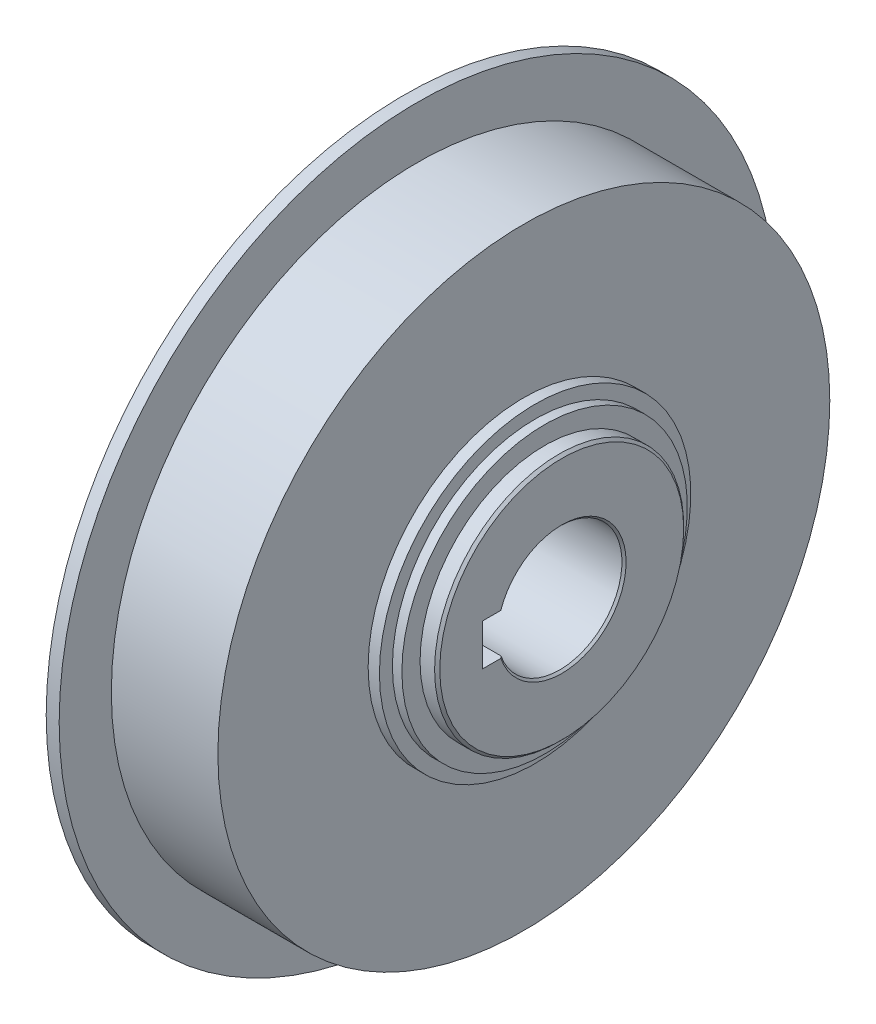
ISO-10303-21;
HEADER;
FILE_DESCRIPTION(('STEP AP214'),'2;1');
FILE_NAME('part.step','',(''),(''),'','','');
FILE_SCHEMA(('AUTOMOTIVE_DESIGN { 1 0 10303 214 1 1 1 1 }'));
ENDSEC;
DATA;
#1=APPLICATION_CONTEXT('core data for automotive mechanical design processes');
#2=APPLICATION_PROTOCOL_DEFINITION('international standard','automotive_design',2000,#1);
#3=PRODUCT_CONTEXT('',#1,'mechanical');
#4=PRODUCT('Part','Part','',(#3));
#5=PRODUCT_RELATED_PRODUCT_CATEGORY('part','',(#4));
#6=PRODUCT_DEFINITION_FORMATION('','',#4);
#7=PRODUCT_DEFINITION_CONTEXT('part definition',#1,'design');
#8=PRODUCT_DEFINITION('design','',#6,#7);
#9=PRODUCT_DEFINITION_SHAPE('','',#8);
#10=(LENGTH_UNIT() NAMED_UNIT(*) SI_UNIT(.MILLI.,.METRE.));
#11=(NAMED_UNIT(*) PLANE_ANGLE_UNIT() SI_UNIT($,.RADIAN.));
#12=(NAMED_UNIT(*) SI_UNIT($,.STERADIAN.) SOLID_ANGLE_UNIT());
#13=UNCERTAINTY_MEASURE_WITH_UNIT(LENGTH_MEASURE(1.E-05),#10,'distance_accuracy_value','');
#14=(GEOMETRIC_REPRESENTATION_CONTEXT(3) GLOBAL_UNCERTAINTY_ASSIGNED_CONTEXT((#13)) GLOBAL_UNIT_ASSIGNED_CONTEXT((#10,
#11,#12)) REPRESENTATION_CONTEXT('',''));
#15=CARTESIAN_POINT('',(0.,0.,0.));
#16=DIRECTION('',(0.,0.,1.));
#17=DIRECTION('',(1.,0.,0.));
#18=AXIS2_PLACEMENT_3D('',#15,#16,#17);
#19=CARTESIAN_POINT('',(83.,0.,0.));
#20=DIRECTION('',(1.,0.,0.));
#21=DIRECTION('',(0.,0.,-1.));
#22=AXIS2_PLACEMENT_3D('',#19,#20,#21);
#23=CONICAL_SURFACE('',#22,12.4,0.785398163397444);
#24=CARTESIAN_POINT('',(82.6,0.,0.));
#25=DIRECTION('',(-1.,0.,0.));
#26=DIRECTION('',(0.,0.,1.));
#27=AXIS2_PLACEMENT_3D('',#24,#25,#26);
#28=CIRCLE('',#27,12.);
#29=CARTESIAN_POINT('',(82.6,4.,11.3137084989848));
#30=VERTEX_POINT('',#29);
#31=CARTESIAN_POINT('',(82.6,-4.,11.3137084989848));
#32=VERTEX_POINT('',#31);
#33=EDGE_CURVE('E80',#30,#32,#28,.T.);
#34=ORIENTED_EDGE('',*,*,#33,.T.);
#35=CARTESIAN_POINT('',(83.,-4.,11.737120600897));
#36=CARTESIAN_POINT('',(82.9332637530497,-4.,11.6666176506962));
#37=CARTESIAN_POINT('',(82.8665622963739,-4.,11.5960818339105));
#38=CARTESIAN_POINT('',(82.73322896304,-4.,11.454944466607));
#39=CARTESIAN_POINT('',(82.6665970863825,-4.,11.3843429160886));
#40=CARTESIAN_POINT('',(82.6,-4.,11.3137084989848));
#41=B_SPLINE_CURVE_WITH_KNOTS('',3,(#35,#36,#37,#38,#39,#40),.UNSPECIFIED.,.F.,.F.,(4,2,4),(0.,
0.291237827128781,0.58247565657841),.UNSPECIFIED.);
#42=CARTESIAN_POINT('',(83.,-4.,11.737120600897));
#43=VERTEX_POINT('',#42);
#44=EDGE_CURVE('E75',#43,#32,#41,.T.);
#45=ORIENTED_EDGE('',*,*,#44,.F.);
#46=CARTESIAN_POINT('',(83.,0.,0.));
#47=DIRECTION('',(1.,0.,0.));
#48=DIRECTION('',(0.,0.,-1.));
#49=AXIS2_PLACEMENT_3D('',#46,#47,#48);
#50=CIRCLE('',#49,12.4);
#51=CARTESIAN_POINT('',(83.,4.,11.737120600897));
#52=VERTEX_POINT('',#51);
#53=EDGE_CURVE('E73',#52,#43,#50,.F.);
#54=ORIENTED_EDGE('',*,*,#53,.F.);
#55=CARTESIAN_POINT('',(82.6,4.,11.3137084989848));
#56=CARTESIAN_POINT('',(82.6665970863825,4.,11.3843429160886));
#57=CARTESIAN_POINT('',(82.73322896304,4.,11.454944466607));
#58=CARTESIAN_POINT('',(82.8665622963739,4.,11.5960818339105));
#59=CARTESIAN_POINT('',(82.9332637530497,4.,11.6666176506962));
#60=CARTESIAN_POINT('',(83.,4.,11.737120600897));
#61=B_SPLINE_CURVE_WITH_KNOTS('',3,(#55,#56,#57,#58,#59,#60),.UNSPECIFIED.,.F.,.F.,(4,2,4),(0.,
0.291237829449631,0.582475656578424),.UNSPECIFIED.);
#62=EDGE_CURVE('E21',#30,#52,#61,.T.);
#63=ORIENTED_EDGE('',*,*,#62,.F.);
#64=EDGE_LOOP('',(#34,#45,#54,#63));
#65=FACE_BOUND('',#64,.T.);
#66=ADVANCED_FACE('F17',(#65),#23,.F.);
#67=CARTESIAN_POINT('',(62.55,0.,0.));
#68=DIRECTION('',(-1.,0.,0.));
#69=DIRECTION('',(0.,0.,1.));
#70=AXIS2_PLACEMENT_3D('',#67,#68,#69);
#71=CYLINDRICAL_SURFACE('',#70,12.);
#72=ORIENTED_EDGE('',*,*,#33,.F.);
#73=DIRECTION('',(1.,0.,0.));
#74=VECTOR('',#73,1.);
#75=CARTESIAN_POINT('',(62.55,4.,11.3137084989848));
#76=LINE('',#75,#74);
#77=CARTESIAN_POINT('',(42.5,4.,11.3137084989848));
#78=VERTEX_POINT('',#77);
#79=EDGE_CURVE('E88',#78,#30,#76,.T.);
#80=ORIENTED_EDGE('',*,*,#79,.F.);
#81=CARTESIAN_POINT('',(42.5,0.,0.));
#82=DIRECTION('',(-1.,0.,0.));
#83=DIRECTION('',(0.,0.,1.));
#84=AXIS2_PLACEMENT_3D('',#81,#82,#83);
#85=CIRCLE('',#84,12.);
#86=CARTESIAN_POINT('',(42.5,-4.,11.3137084989848));
#87=VERTEX_POINT('',#86);
#88=EDGE_CURVE('E94',#78,#87,#85,.T.);
#89=ORIENTED_EDGE('',*,*,#88,.T.);
#90=DIRECTION('',(1.,0.,0.));
#91=VECTOR('',#90,1.);
#92=CARTESIAN_POINT('',(62.55,-4.,11.3137084989848));
#93=LINE('',#92,#91);
#94=EDGE_CURVE('E79',#32,#87,#93,.F.);
#95=ORIENTED_EDGE('',*,*,#94,.F.);
#96=EDGE_LOOP('',(#72,#80,#89,#95));
#97=FACE_BOUND('',#96,.T.);
#98=ADVANCED_FACE('F308',(#97),#71,.F.);
#99=CARTESIAN_POINT('',(83.,0.,17.95));
#100=DIRECTION('',(1.,0.,0.));
#101=DIRECTION('',(0.,0.,-1.));
#102=AXIS2_PLACEMENT_3D('',#99,#100,#101);
#103=PLANE('',#102);
#104=DIRECTION('',(0.,0.,-1.));
#105=VECTOR('',#104,1.);
#106=CARTESIAN_POINT('',(83.,4.,7.65));
#107=LINE('',#106,#105);
#108=CARTESIAN_POINT('',(83.,4.,15.3));
#109=VERTEX_POINT('',#108);
#110=EDGE_CURVE('E85',#52,#109,#107,.F.);
#111=ORIENTED_EDGE('',*,*,#110,.F.);
#112=ORIENTED_EDGE('',*,*,#53,.T.);
#113=DIRECTION('',(0.,0.,1.));
#114=VECTOR('',#113,1.);
#115=CARTESIAN_POINT('',(83.,-4.,7.65));
#116=LINE('',#115,#114);
#117=CARTESIAN_POINT('',(83.,-4.,15.3));
#118=VERTEX_POINT('',#117);
#119=EDGE_CURVE('E110',#118,#43,#116,.F.);
#120=ORIENTED_EDGE('',*,*,#119,.F.);
#121=DIRECTION('',(0.,1.,0.));
#122=VECTOR('',#121,1.);
#123=CARTESIAN_POINT('',(83.,0.,15.3));
#124=LINE('',#123,#122);
#125=EDGE_CURVE('E92',#118,#109,#124,.T.);
#126=ORIENTED_EDGE('',*,*,#125,.T.);
#127=EDGE_LOOP('',(#111,#112,#120,#126));
#128=FACE_BOUND('',#127,.T.);
#129=CARTESIAN_POINT('',(83.,0.,0.));
#130=DIRECTION('',(-1.,0.,0.));
#131=DIRECTION('',(0.,0.,1.));
#132=AXIS2_PLACEMENT_3D('',#129,#130,#131);
#133=CIRCLE('',#132,23.5);
#134=CARTESIAN_POINT('',(83.,0.,23.5));
#135=VERTEX_POINT('',#134);
#136=EDGE_CURVE('E149',#135,#135,#133,.T.);
#137=ORIENTED_EDGE('',*,*,#136,.F.);
#138=EDGE_LOOP('',(#137));
#139=FACE_BOUND('',#138,.T.);
#140=ADVANCED_FACE('F89',(#128,#139),#103,.T.);
#141=CARTESIAN_POINT('',(62.55,-4.,7.65));
#142=DIRECTION('',(0.,1.,0.));
#143=DIRECTION('',(0.,0.,1.));
#144=AXIS2_PLACEMENT_3D('',#141,#142,#143);
#145=PLANE('',#144);
#146=DIRECTION('',(1.,0.,0.));
#147=VECTOR('',#146,1.);
#148=CARTESIAN_POINT('',(62.55,-4.,15.3));
#149=LINE('',#148,#147);
#150=CARTESIAN_POINT('',(42.1,-4.,15.3));
#151=VERTEX_POINT('',#150);
#152=EDGE_CURVE('E384',#151,#118,#149,.T.);
#153=ORIENTED_EDGE('',*,*,#152,.T.);
#154=ORIENTED_EDGE('',*,*,#119,.T.);
#155=ORIENTED_EDGE('',*,*,#44,.T.);
#156=ORIENTED_EDGE('',*,*,#94,.T.);
#157=CARTESIAN_POINT('',(42.5,-4.,11.3137084989848));
#158=CARTESIAN_POINT('',(42.4334029136175,-4.,11.3843429160886));
#159=CARTESIAN_POINT('',(42.36677103696,-4.,11.454944466607));
#160=CARTESIAN_POINT('',(42.2334377036261,-4.,11.5960818339105));
#161=CARTESIAN_POINT('',(42.1667362469503,-4.,11.6666176506962));
#162=CARTESIAN_POINT('',(42.1,-4.,11.737120600897));
#163=B_SPLINE_CURVE_WITH_KNOTS('',3,(#157,#158,#159,#160,#161,#162),.UNSPECIFIED.,.F.,.F.,(4,2,
4),(0.,0.291237829449631,0.582475656578412),.UNSPECIFIED.);
#164=CARTESIAN_POINT('',(42.1,-4.,11.737120600897));
#165=VERTEX_POINT('',#164);
#166=EDGE_CURVE('E97',#87,#165,#163,.T.);
#167=ORIENTED_EDGE('',*,*,#166,.T.);
#168=DIRECTION('',(0.,0.,1.));
#169=VECTOR('',#168,1.);
#170=CARTESIAN_POINT('',(42.1,-4.,32.2625));
#171=LINE('',#170,#169);
#172=EDGE_CURVE('E148',#151,#165,#171,.F.);
#173=ORIENTED_EDGE('',*,*,#172,.F.);
#174=EDGE_LOOP('',(#153,#154,#155,#156,#167,#173));
#175=FACE_BOUND('',#174,.T.);
#176=ADVANCED_FACE('F295',(#175),#145,.T.);
#177=CARTESIAN_POINT('',(42.1,0.,0.));
#178=DIRECTION('',(-1.,0.,0.));
#179=DIRECTION('',(0.,0.,1.));
#180=AXIS2_PLACEMENT_3D('',#177,#178,#179);
#181=CONICAL_SURFACE('',#180,12.4,0.78539816339745);
#182=ORIENTED_EDGE('',*,*,#88,.F.);
#183=CARTESIAN_POINT('',(42.1,4.,11.737120600897));
#184=CARTESIAN_POINT('',(42.1667362469503,4.,11.6666176506962));
#185=CARTESIAN_POINT('',(42.2334377036261,4.,11.5960818339105));
#186=CARTESIAN_POINT('',(42.36677103696,4.,11.454944466607));
#187=CARTESIAN_POINT('',(42.4334029136175,4.,11.3843429160886));
#188=CARTESIAN_POINT('',(42.5,4.,11.3137084989848));
#189=B_SPLINE_CURVE_WITH_KNOTS('',3,(#183,#184,#185,#186,#187,#188),.UNSPECIFIED.,.F.,.F.,(4,2,
4),(0.,0.291237827128772,0.582475656578396),.UNSPECIFIED.);
#190=CARTESIAN_POINT('',(42.1,4.,11.737120600897));
#191=VERTEX_POINT('',#190);
#192=EDGE_CURVE('E93',#191,#78,#189,.T.);
#193=ORIENTED_EDGE('',*,*,#192,.F.);
#194=CARTESIAN_POINT('',(42.1,0.,0.));
#195=DIRECTION('',(-1.,0.,0.));
#196=DIRECTION('',(0.,0.,1.));
#197=AXIS2_PLACEMENT_3D('',#194,#195,#196);
#198=CIRCLE('',#197,12.4);
#199=EDGE_CURVE('E144',#165,#191,#198,.F.);
#200=ORIENTED_EDGE('',*,*,#199,.F.);
#201=ORIENTED_EDGE('',*,*,#166,.F.);
#202=EDGE_LOOP('',(#182,#193,#200,#201));
#203=FACE_BOUND('',#202,.T.);
#204=ADVANCED_FACE('F160',(#203),#181,.F.);
#205=CARTESIAN_POINT('',(62.55,4.,7.65));
#206=DIRECTION('',(0.,-1.,0.));
#207=DIRECTION('',(0.,0.,-1.));
#208=AXIS2_PLACEMENT_3D('',#205,#206,#207);
#209=PLANE('',#208);
#210=ORIENTED_EDGE('',*,*,#192,.T.);
#211=ORIENTED_EDGE('',*,*,#79,.T.);
#212=ORIENTED_EDGE('',*,*,#62,.T.);
#213=ORIENTED_EDGE('',*,*,#110,.T.);
#214=DIRECTION('',(1.,0.,0.));
#215=VECTOR('',#214,1.);
#216=CARTESIAN_POINT('',(62.55,4.,15.3));
#217=LINE('',#216,#215);
#218=CARTESIAN_POINT('',(42.1,4.,15.3));
#219=VERTEX_POINT('',#218);
#220=EDGE_CURVE('E40',#109,#219,#217,.F.);
#221=ORIENTED_EDGE('',*,*,#220,.T.);
#222=DIRECTION('',(0.,0.,1.));
#223=VECTOR('',#222,1.);
#224=CARTESIAN_POINT('',(42.1,4.,32.2625));
#225=LINE('',#224,#223);
#226=EDGE_CURVE('E147',#191,#219,#225,.T.);
#227=ORIENTED_EDGE('',*,*,#226,.F.);
#228=EDGE_LOOP('',(#210,#211,#212,#213,#221,#227));
#229=FACE_BOUND('',#228,.T.);
#230=ADVANCED_FACE('F84',(#229),#209,.T.);
#231=CARTESIAN_POINT('',(62.55,0.,15.3));
#232=DIRECTION('',(0.,0.,1.));
#233=DIRECTION('',(1.,0.,0.));
#234=AXIS2_PLACEMENT_3D('',#231,#232,#233);
#235=PLANE('',#234);
#236=ORIENTED_EDGE('',*,*,#152,.F.);
#237=DIRECTION('',(0.,1.,0.));
#238=VECTOR('',#237,1.);
#239=CARTESIAN_POINT('',(42.1,0.,15.3));
#240=LINE('',#239,#238);
#241=EDGE_CURVE('E392',#219,#151,#240,.F.);
#242=ORIENTED_EDGE('',*,*,#241,.F.);
#243=ORIENTED_EDGE('',*,*,#220,.F.);
#244=ORIENTED_EDGE('',*,*,#125,.F.);
#245=EDGE_LOOP('',(#236,#242,#243,#244));
#246=FACE_BOUND('',#245,.T.);
#247=ADVANCED_FACE('F165',(#246),#235,.F.);
#248=CARTESIAN_POINT('',(82.5,0.,0.));
#249=DIRECTION('',(-1.,0.,0.));
#250=DIRECTION('',(0.,0.,1.));
#251=AXIS2_PLACEMENT_3D('',#248,#249,#250);
#252=CONICAL_SURFACE('',#251,24.,0.785398163397448);
#253=ORIENTED_EDGE('',*,*,#136,.T.);
#254=EDGE_LOOP('',(#253));
#255=FACE_BOUND('',#254,.T.);
#256=CARTESIAN_POINT('',(82.5,0.,0.));
#257=DIRECTION('',(-1.,0.,0.));
#258=DIRECTION('',(0.,0.,1.));
#259=AXIS2_PLACEMENT_3D('',#256,#257,#258);
#260=CIRCLE('',#259,24.);
#261=CARTESIAN_POINT('',(82.5,0.,24.));
#262=VERTEX_POINT('',#261);
#263=EDGE_CURVE('E143',#262,#262,#260,.T.);
#264=ORIENTED_EDGE('',*,*,#263,.F.);
#265=EDGE_LOOP('',(#264));
#266=FACE_BOUND('',#265,.T.);
#267=ADVANCED_FACE('F169',(#255,#266),#252,.T.);
#268=CARTESIAN_POINT('',(42.1,0.,32.2625));
#269=DIRECTION('',(-1.,0.,0.));
#270=DIRECTION('',(0.,0.,1.));
#271=AXIS2_PLACEMENT_3D('',#268,#269,#270);
#272=PLANE('',#271);
#273=CARTESIAN_POINT('',(42.1,0.,0.));
#274=DIRECTION('',(-1.,0.,0.));
#275=DIRECTION('',(0.,0.,1.));
#276=AXIS2_PLACEMENT_3D('',#273,#274,#275);
#277=CIRCLE('',#276,52.125);
#278=CARTESIAN_POINT('',(42.1,0.,52.125));
#279=VERTEX_POINT('',#278);
#280=EDGE_CURVE('E140',#279,#279,#277,.F.);
#281=ORIENTED_EDGE('',*,*,#280,.F.);
#282=EDGE_LOOP('',(#281));
#283=FACE_BOUND('',#282,.T.);
#284=ORIENTED_EDGE('',*,*,#226,.T.);
#285=ORIENTED_EDGE('',*,*,#241,.T.);
#286=ORIENTED_EDGE('',*,*,#172,.T.);
#287=ORIENTED_EDGE('',*,*,#199,.T.);
#288=EDGE_LOOP('',(#284,#285,#286,#287));
#289=FACE_BOUND('',#288,.T.);
#290=ADVANCED_FACE('F173',(#283,#289),#272,.T.);
#291=CARTESIAN_POINT('',(81.1,0.,0.));
#292=DIRECTION('',(-1.,0.,0.));
#293=DIRECTION('',(0.,0.,1.));
#294=AXIS2_PLACEMENT_3D('',#291,#292,#293);
#295=CYLINDRICAL_SURFACE('',#294,24.);
#296=ORIENTED_EDGE('',*,*,#263,.T.);
#297=EDGE_LOOP('',(#296));
#298=FACE_BOUND('',#297,.T.);
#299=CARTESIAN_POINT('',(79.7,0.,0.));
#300=DIRECTION('',(-1.,0.,0.));
#301=DIRECTION('',(0.,0.,1.));
#302=AXIS2_PLACEMENT_3D('',#299,#300,#301);
#303=CIRCLE('',#302,24.);
#304=CARTESIAN_POINT('',(79.7,0.,24.));
#305=VERTEX_POINT('',#304);
#306=EDGE_CURVE('E137',#305,#305,#303,.T.);
#307=ORIENTED_EDGE('',*,*,#306,.F.);
#308=EDGE_LOOP('',(#307));
#309=FACE_BOUND('',#308,.T.);
#310=ADVANCED_FACE('F177',(#298,#309),#295,.T.);
#311=CARTESIAN_POINT('',(47.385,0.,0.));
#312=DIRECTION('',(-1.,0.,0.));
#313=DIRECTION('',(0.,0.,1.));
#314=AXIS2_PLACEMENT_3D('',#311,#312,#313);
#315=CYLINDRICAL_SURFACE('',#314,52.125);
#316=CARTESIAN_POINT('',(52.67,0.,0.));
#317=DIRECTION('',(-1.,0.,0.));
#318=DIRECTION('',(0.,0.,1.));
#319=AXIS2_PLACEMENT_3D('',#316,#317,#318);
#320=CIRCLE('',#319,52.125);
#321=CARTESIAN_POINT('',(52.67,0.,52.125));
#322=VERTEX_POINT('',#321);
#323=EDGE_CURVE('E134',#322,#322,#320,.F.);
#324=ORIENTED_EDGE('',*,*,#323,.F.);
#325=EDGE_LOOP('',(#324));
#326=FACE_BOUND('',#325,.T.);
#327=ORIENTED_EDGE('',*,*,#280,.T.);
#328=EDGE_LOOP('',(#327));
#329=FACE_BOUND('',#328,.T.);
#330=ADVANCED_FACE('F181',(#326,#329),#315,.T.);
#331=CARTESIAN_POINT('',(79.7,0.,25.75));
#332=DIRECTION('',(1.,0.,0.));
#333=DIRECTION('',(0.,0.,-1.));
#334=AXIS2_PLACEMENT_3D('',#331,#332,#333);
#335=PLANE('',#334);
#336=CARTESIAN_POINT('',(79.7,0.,0.));
#337=DIRECTION('',(-1.,0.,0.));
#338=DIRECTION('',(0.,0.,1.));
#339=AXIS2_PLACEMENT_3D('',#336,#337,#338);
#340=CIRCLE('',#339,27.5);
#341=CARTESIAN_POINT('',(79.7,0.,27.5));
#342=VERTEX_POINT('',#341);
#343=EDGE_CURVE('E131',#342,#342,#340,.T.);
#344=ORIENTED_EDGE('',*,*,#343,.F.);
#345=EDGE_LOOP('',(#344));
#346=FACE_BOUND('',#345,.T.);
#347=ORIENTED_EDGE('',*,*,#306,.T.);
#348=EDGE_LOOP('',(#347));
#349=FACE_BOUND('',#348,.T.);
#350=ADVANCED_FACE('F185',(#346,#349),#335,.T.);
#351=CARTESIAN_POINT('',(52.67,0.,60.5625));
#352=DIRECTION('',(-1.,0.,0.));
#353=DIRECTION('',(0.,0.,1.));
#354=AXIS2_PLACEMENT_3D('',#351,#352,#353);
#355=PLANE('',#354);
#356=ORIENTED_EDGE('',*,*,#323,.T.);
#357=EDGE_LOOP('',(#356));
#358=FACE_BOUND('',#357,.T.);
#359=CARTESIAN_POINT('',(52.67,0.,0.));
#360=DIRECTION('',(-1.,0.,0.));
#361=DIRECTION('',(0.,0.,1.));
#362=AXIS2_PLACEMENT_3D('',#359,#360,#361);
#363=CIRCLE('',#362,69.);
#364=CARTESIAN_POINT('',(52.67,0.,69.));
#365=VERTEX_POINT('',#364);
#366=EDGE_CURVE('E128',#365,#365,#363,.F.);
#367=ORIENTED_EDGE('',*,*,#366,.F.);
#368=EDGE_LOOP('',(#367));
#369=FACE_BOUND('',#368,.T.);
#370=ADVANCED_FACE('F189',(#358,#369),#355,.T.);
#371=CARTESIAN_POINT('',(78.785,0.,0.));
#372=DIRECTION('',(-1.,0.,0.));
#373=DIRECTION('',(0.,0.,1.));
#374=AXIS2_PLACEMENT_3D('',#371,#372,#373);
#375=CYLINDRICAL_SURFACE('',#374,27.5);
#376=ORIENTED_EDGE('',*,*,#343,.T.);
#377=EDGE_LOOP('',(#376));
#378=FACE_BOUND('',#377,.T.);
#379=CARTESIAN_POINT('',(77.87,0.,0.));
#380=DIRECTION('',(-1.,0.,0.));
#381=DIRECTION('',(0.,0.,1.));
#382=AXIS2_PLACEMENT_3D('',#379,#380,#381);
#383=CIRCLE('',#382,27.5);
#384=CARTESIAN_POINT('',(77.87,0.,27.5));
#385=VERTEX_POINT('',#384);
#386=EDGE_CURVE('E125',#385,#385,#383,.T.);
#387=ORIENTED_EDGE('',*,*,#386,.F.);
#388=EDGE_LOOP('',(#387));
#389=FACE_BOUND('',#388,.T.);
#390=ADVANCED_FACE('F193',(#378,#389),#375,.T.);
#391=CARTESIAN_POINT('',(53.92,0.,0.));
#392=DIRECTION('',(-1.,0.,0.));
#393=DIRECTION('',(0.,0.,1.));
#394=AXIS2_PLACEMENT_3D('',#391,#392,#393);
#395=CYLINDRICAL_SURFACE('',#394,69.);
#396=CARTESIAN_POINT('',(55.17,0.,0.));
#397=DIRECTION('',(-1.,0.,0.));
#398=DIRECTION('',(0.,0.,1.));
#399=AXIS2_PLACEMENT_3D('',#396,#397,#398);
#400=CIRCLE('',#399,69.);
#401=CARTESIAN_POINT('',(55.17,0.,69.));
#402=VERTEX_POINT('',#401);
#403=EDGE_CURVE('E122',#402,#402,#400,.F.);
#404=ORIENTED_EDGE('',*,*,#403,.F.);
#405=EDGE_LOOP('',(#404));
#406=FACE_BOUND('',#405,.T.);
#407=ORIENTED_EDGE('',*,*,#366,.T.);
#408=EDGE_LOOP('',(#407));
#409=FACE_BOUND('',#408,.T.);
#410=ADVANCED_FACE('F197',(#406,#409),#395,.T.);
#411=CARTESIAN_POINT('',(77.87,0.,28.75));
#412=DIRECTION('',(1.,0.,0.));
#413=DIRECTION('',(0.,0.,-1.));
#414=AXIS2_PLACEMENT_3D('',#411,#412,#413);
#415=PLANE('',#414);
#416=CARTESIAN_POINT('',(77.87,0.,0.));
#417=DIRECTION('',(-1.,0.,0.));
#418=DIRECTION('',(0.,0.,1.));
#419=AXIS2_PLACEMENT_3D('',#416,#417,#418);
#420=CIRCLE('',#419,30.);
#421=CARTESIAN_POINT('',(77.87,0.,30.));
#422=VERTEX_POINT('',#421);
#423=EDGE_CURVE('E119',#422,#422,#420,.T.);
#424=ORIENTED_EDGE('',*,*,#423,.F.);
#425=EDGE_LOOP('',(#424));
#426=FACE_BOUND('',#425,.T.);
#427=ORIENTED_EDGE('',*,*,#386,.T.);
#428=EDGE_LOOP('',(#427));
#429=FACE_BOUND('',#428,.T.);
#430=ADVANCED_FACE('F201',(#426,#429),#415,.T.);
#431=CARTESIAN_POINT('',(55.17,0.,63.975));
#432=DIRECTION('',(1.,0.,0.));
#433=DIRECTION('',(0.,0.,-1.));
#434=AXIS2_PLACEMENT_3D('',#431,#432,#433);
#435=PLANE('',#434);
#436=ORIENTED_EDGE('',*,*,#403,.T.);
#437=EDGE_LOOP('',(#436));
#438=FACE_BOUND('',#437,.T.);
#439=CARTESIAN_POINT('',(55.17,0.,0.));
#440=DIRECTION('',(-1.,0.,0.));
#441=DIRECTION('',(0.,0.,1.));
#442=AXIS2_PLACEMENT_3D('',#439,#440,#441);
#443=CIRCLE('',#442,58.95);
#444=CARTESIAN_POINT('',(55.17,0.,58.95));
#445=VERTEX_POINT('',#444);
#446=EDGE_CURVE('E116',#445,#445,#443,.F.);
#447=ORIENTED_EDGE('',*,*,#446,.F.);
#448=EDGE_LOOP('',(#447));
#449=FACE_BOUND('',#448,.T.);
#450=ADVANCED_FACE('F205',(#438,#449),#435,.T.);
#451=CARTESIAN_POINT('',(76.785,0.,0.));
#452=DIRECTION('',(-1.,0.,0.));
#453=DIRECTION('',(0.,0.,1.));
#454=AXIS2_PLACEMENT_3D('',#451,#452,#453);
#455=CYLINDRICAL_SURFACE('',#454,30.);
#456=ORIENTED_EDGE('',*,*,#423,.T.);
#457=EDGE_LOOP('',(#456));
#458=FACE_BOUND('',#457,.T.);
#459=CARTESIAN_POINT('',(75.7,0.,0.));
#460=DIRECTION('',(-1.,0.,0.));
#461=DIRECTION('',(0.,0.,1.));
#462=AXIS2_PLACEMENT_3D('',#459,#460,#461);
#463=CIRCLE('',#462,30.);
#464=CARTESIAN_POINT('',(75.7,0.,30.));
#465=VERTEX_POINT('',#464);
#466=EDGE_CURVE('E31',#465,#465,#463,.T.);
#467=ORIENTED_EDGE('',*,*,#466,.F.);
#468=EDGE_LOOP('',(#467));
#469=FACE_BOUND('',#468,.T.);
#470=ADVANCED_FACE('F209',(#458,#469),#455,.T.);
#471=CARTESIAN_POINT('',(65.435,0.,0.));
#472=DIRECTION('',(-1.,0.,0.));
#473=DIRECTION('',(0.,0.,1.));
#474=AXIS2_PLACEMENT_3D('',#471,#472,#473);
#475=CYLINDRICAL_SURFACE('',#474,58.95);
#476=CARTESIAN_POINT('',(75.7,0.,0.));
#477=DIRECTION('',(-1.,0.,0.));
#478=DIRECTION('',(0.,0.,1.));
#479=AXIS2_PLACEMENT_3D('',#476,#477,#478);
#480=CIRCLE('',#479,58.95);
#481=CARTESIAN_POINT('',(75.7,0.,58.95));
#482=VERTEX_POINT('',#481);
#483=EDGE_CURVE('E11',#482,#482,#480,.F.);
#484=ORIENTED_EDGE('',*,*,#483,.F.);
#485=EDGE_LOOP('',(#484));
#486=FACE_BOUND('',#485,.T.);
#487=ORIENTED_EDGE('',*,*,#446,.T.);
#488=EDGE_LOOP('',(#487));
#489=FACE_BOUND('',#488,.T.);
#490=ADVANCED_FACE('F213',(#486,#489),#475,.T.);
#491=CARTESIAN_POINT('',(75.7,0.,44.475));
#492=DIRECTION('',(1.,0.,0.));
#493=DIRECTION('',(0.,0.,-1.));
#494=AXIS2_PLACEMENT_3D('',#491,#492,#493);
#495=PLANE('',#494);
#496=ORIENTED_EDGE('',*,*,#483,.T.);
#497=EDGE_LOOP('',(#496));
#498=FACE_BOUND('',#497,.T.);
#499=ORIENTED_EDGE('',*,*,#466,.T.);
#500=EDGE_LOOP('',(#499));
#501=FACE_BOUND('',#500,.T.);
#502=ADVANCED_FACE('F217',(#498,#501),#495,.T.);
#503=CLOSED_SHELL('',(#66,#98,#140,#176,#204,#230,#247,#267,#290,#310,#330,#350,#370,#390,#410,
#430,#450,#470,#490,#502));
#504=MANIFOLD_SOLID_BREP('B1',#503);
#505=ADVANCED_BREP_SHAPE_REPRESENTATION('',(#18,#504),#14);
#506=SHAPE_DEFINITION_REPRESENTATION(#9,#505);
ENDSEC;
END-ISO-10303-21;
